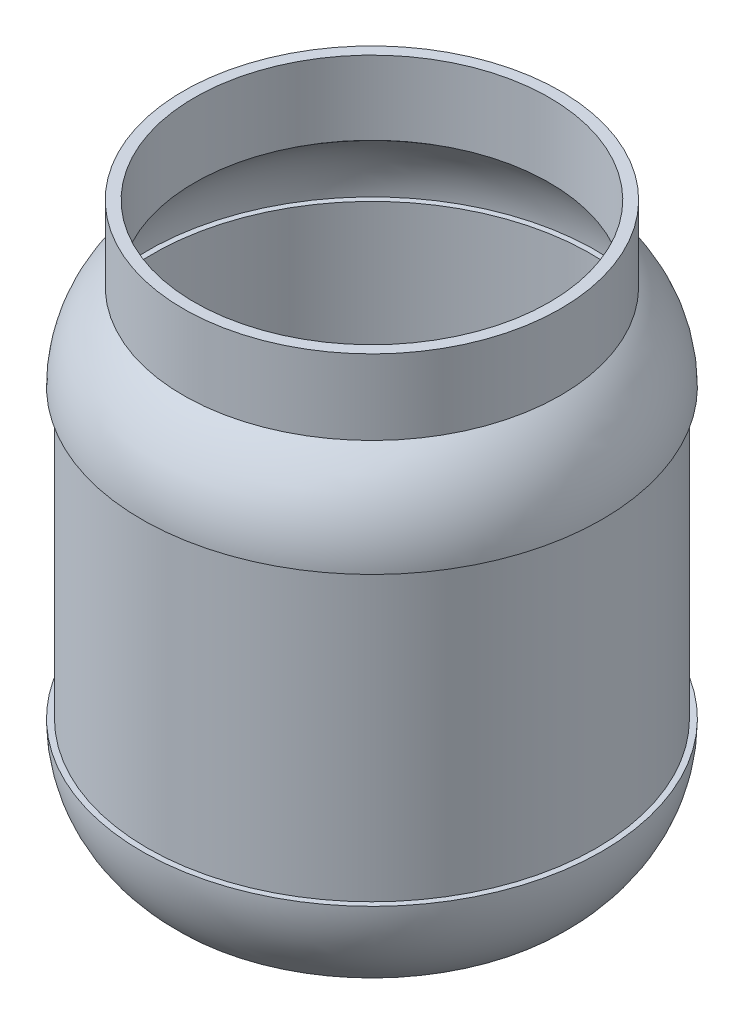
ISO-10303-21;
HEADER;
FILE_DESCRIPTION(('STEP AP214'),'2;1');
FILE_NAME('part.step','',(''),(''),'','','');
FILE_SCHEMA(('AUTOMOTIVE_DESIGN { 1 0 10303 214 1 1 1 1 }'));
ENDSEC;
DATA;
#1=APPLICATION_CONTEXT('core data for automotive mechanical design processes');
#2=APPLICATION_PROTOCOL_DEFINITION('international standard','automotive_design',2000,#1);
#3=PRODUCT_CONTEXT('',#1,'mechanical');
#4=PRODUCT('Part','Part','',(#3));
#5=PRODUCT_RELATED_PRODUCT_CATEGORY('part','',(#4));
#6=PRODUCT_DEFINITION_FORMATION('','',#4);
#7=PRODUCT_DEFINITION_CONTEXT('part definition',#1,'design');
#8=PRODUCT_DEFINITION('design','',#6,#7);
#9=PRODUCT_DEFINITION_SHAPE('','',#8);
#10=(LENGTH_UNIT() NAMED_UNIT(*) SI_UNIT(.MILLI.,.METRE.));
#11=(NAMED_UNIT(*) PLANE_ANGLE_UNIT() SI_UNIT($,.RADIAN.));
#12=(NAMED_UNIT(*) SI_UNIT($,.STERADIAN.) SOLID_ANGLE_UNIT());
#13=UNCERTAINTY_MEASURE_WITH_UNIT(LENGTH_MEASURE(1.E-05),#10,'distance_accuracy_value','');
#14=(GEOMETRIC_REPRESENTATION_CONTEXT(3) GLOBAL_UNCERTAINTY_ASSIGNED_CONTEXT((#13)) GLOBAL_UNIT_ASSIGNED_CONTEXT((#10,
#11,#12)) REPRESENTATION_CONTEXT('',''));
#15=CARTESIAN_POINT('',(0.,0.,0.));
#16=DIRECTION('',(0.,0.,1.));
#17=DIRECTION('',(1.,0.,0.));
#18=AXIS2_PLACEMENT_3D('',#15,#16,#17);
#19=CARTESIAN_POINT('',(0.,100.33,0.));
#20=DIRECTION('',(0.,-1.,0.));
#21=DIRECTION('',(1.,0.,0.));
#22=AXIS2_PLACEMENT_3D('',#19,#20,#21);
#23=TOROIDAL_SURFACE('',#22,33.6428148648649,29.8571851351351);
#24=CARTESIAN_POINT('',(0.,125.199035014533,0.));
#25=DIRECTION('',(0.,-1.,0.));
#26=DIRECTION('',(1.,0.,0.));
#27=AXIS2_PLACEMENT_3D('',#24,#25,#26);
#28=CIRCLE('',#27,50.165);
#29=CARTESIAN_POINT('',(50.165,125.199035014533,0.));
#30=VERTEX_POINT('',#29);
#31=EDGE_CURVE('E150',#30,#30,#28,.T.);
#32=ORIENTED_EDGE('',*,*,#31,.F.);
#33=EDGE_LOOP('',(#32));
#34=FACE_BOUND('',#33,.T.);
#35=CARTESIAN_POINT('',(0.,101.9175,0.));
#36=DIRECTION('',(0.,-1.,0.));
#37=DIRECTION('',(1.,0.,0.));
#38=AXIS2_PLACEMENT_3D('',#35,#36,#37);
#39=CIRCLE('',#38,63.4577666163558);
#40=CARTESIAN_POINT('',(63.4577666163558,101.9175,0.));
#41=VERTEX_POINT('',#40);
#42=EDGE_CURVE('E10',#41,#41,#39,.T.);
#43=ORIENTED_EDGE('',*,*,#42,.T.);
#44=EDGE_LOOP('',(#43));
#45=FACE_BOUND('',#44,.T.);
#46=ADVANCED_FACE('F43',(#34,#45),#23,.F.);
#47=CARTESIAN_POINT('',(0.,101.9175,0.));
#48=DIRECTION('',(0.,-1.,0.));
#49=DIRECTION('',(1.,0.,0.));
#50=AXIS2_PLACEMENT_3D('',#47,#48,#49);
#51=PLANE('',#50);
#52=ORIENTED_EDGE('',*,*,#42,.F.);
#53=EDGE_LOOP('',(#52));
#54=FACE_BOUND('',#53,.T.);
#55=CARTESIAN_POINT('',(0.,101.9175,0.));
#56=DIRECTION('',(0.,-1.,0.));
#57=DIRECTION('',(1.,0.,0.));
#58=AXIS2_PLACEMENT_3D('',#55,#56,#57);
#59=CIRCLE('',#58,61.9125);
#60=CARTESIAN_POINT('',(61.9125,101.9175,0.));
#61=VERTEX_POINT('',#60);
#62=EDGE_CURVE('E50',#61,#61,#59,.T.);
#63=ORIENTED_EDGE('',*,*,#62,.T.);
#64=EDGE_LOOP('',(#63));
#65=FACE_BOUND('',#64,.T.);
#66=ADVANCED_FACE('F159',(#54,#65),#51,.F.);
#67=CARTESIAN_POINT('',(0.,0.,0.));
#68=DIRECTION('',(0.,-1.,0.));
#69=DIRECTION('',(1.,0.,0.));
#70=AXIS2_PLACEMENT_3D('',#67,#68,#69);
#71=CYLINDRICAL_SURFACE('',#70,61.9125);
#72=ORIENTED_EDGE('',*,*,#62,.F.);
#73=EDGE_LOOP('',(#72));
#74=FACE_BOUND('',#73,.T.);
#75=CARTESIAN_POINT('',(0.,17.4625,0.));
#76=DIRECTION('',(0.,-1.,0.));
#77=DIRECTION('',(1.,0.,0.));
#78=AXIS2_PLACEMENT_3D('',#75,#76,#77);
#79=CIRCLE('',#78,61.9125);
#80=CARTESIAN_POINT('',(61.9125,17.4625,0.));
#81=VERTEX_POINT('',#80);
#82=EDGE_CURVE('E55',#81,#81,#79,.T.);
#83=ORIENTED_EDGE('',*,*,#82,.T.);
#84=EDGE_LOOP('',(#83));
#85=FACE_BOUND('',#84,.T.);
#86=ADVANCED_FACE('F163',(#74,#85),#71,.F.);
#87=CARTESIAN_POINT('',(0.,17.4625,0.));
#88=DIRECTION('',(0.,-1.,0.));
#89=DIRECTION('',(1.,0.,0.));
#90=AXIS2_PLACEMENT_3D('',#87,#88,#89);
#91=PLANE('',#90);
#92=CARTESIAN_POINT('',(0.,17.4625,0.));
#93=DIRECTION('',(0.,-1.,0.));
#94=DIRECTION('',(1.,0.,0.));
#95=AXIS2_PLACEMENT_3D('',#92,#93,#94);
#96=CIRCLE('',#95,63.4617905923927);
#97=CARTESIAN_POINT('',(63.4617905923927,17.4625,0.));
#98=VERTEX_POINT('',#97);
#99=EDGE_CURVE('E60',#98,#98,#96,.T.);
#100=ORIENTED_EDGE('',*,*,#99,.T.);
#101=EDGE_LOOP('',(#100));
#102=FACE_BOUND('',#101,.T.);
#103=ORIENTED_EDGE('',*,*,#82,.F.);
#104=EDGE_LOOP('',(#103));
#105=FACE_BOUND('',#104,.T.);
#106=ADVANCED_FACE('F168',(#102,#105),#91,.T.);
#107=CARTESIAN_POINT('',(0.,19.05,0.));
#108=DIRECTION('',(0.,-1.,0.));
#109=DIRECTION('',(1.,0.,0.));
#110=AXIS2_PLACEMENT_3D('',#107,#108,#109);
#111=DEGENERATE_TOROIDAL_SURFACE('',#110,30.5026785714286,32.9973214285714,.T.);
#112=CARTESIAN_POINT('',(0.,-4.7625,0.));
#113=DIRECTION('',(0.,-1.,0.));
#114=DIRECTION('',(1.,0.,0.));
#115=AXIS2_PLACEMENT_3D('',#112,#113,#114);
#116=CIRCLE('',#115,53.3453593512858);
#117=CARTESIAN_POINT('',(53.3453593512858,-4.7625,0.));
#118=VERTEX_POINT('',#117);
#119=EDGE_CURVE('E66',#118,#118,#116,.T.);
#120=ORIENTED_EDGE('',*,*,#119,.T.);
#121=EDGE_LOOP('',(#120));
#122=FACE_BOUND('',#121,.T.);
#123=ORIENTED_EDGE('',*,*,#99,.F.);
#124=EDGE_LOOP('',(#123));
#125=FACE_BOUND('',#124,.T.);
#126=ADVANCED_FACE('F174',(#122,#125),#111,.F.);
#127=CARTESIAN_POINT('',(0.,-4.7625,0.));
#128=DIRECTION('',(0.,-1.,0.));
#129=DIRECTION('',(1.,0.,0.));
#130=AXIS2_PLACEMENT_3D('',#127,#128,#129);
#131=PLANE('',#130);
#132=ORIENTED_EDGE('',*,*,#119,.F.);
#133=EDGE_LOOP('',(#132));
#134=FACE_BOUND('',#133,.T.);
#135=CARTESIAN_POINT('',(0.,-4.7625,0.));
#136=DIRECTION('',(0.,-1.,0.));
#137=DIRECTION('',(1.,0.,0.));
#138=AXIS2_PLACEMENT_3D('',#135,#136,#137);
#139=CIRCLE('',#138,51.4766208782978);
#140=CARTESIAN_POINT('',(51.4766208782978,-4.7625,0.));
#141=VERTEX_POINT('',#140);
#142=EDGE_CURVE('E70',#141,#141,#139,.T.);
#143=ORIENTED_EDGE('',*,*,#142,.T.);
#144=EDGE_LOOP('',(#143));
#145=FACE_BOUND('',#144,.T.);
#146=ADVANCED_FACE('F178',(#134,#145),#131,.F.);
#147=CARTESIAN_POINT('',(0.,-2.64583333333333,0.));
#148=DIRECTION('',(0.,-1.,0.));
#149=DIRECTION('',(1.,0.,0.));
#150=AXIS2_PLACEMENT_3D('',#147,#148,#149);
#151=CONICAL_SURFACE('',#150,49.4446208782977,0.764992832710913);
#152=ORIENTED_EDGE('',*,*,#142,.F.);
#153=EDGE_LOOP('',(#152));
#154=FACE_BOUND('',#153,.T.);
#155=CARTESIAN_POINT('',(0.,-2.64583333333333,0.));
#156=DIRECTION('',(0.,-1.,0.));
#157=DIRECTION('',(1.,0.,0.));
#158=AXIS2_PLACEMENT_3D('',#155,#156,#157);
#159=CIRCLE('',#158,49.4446208782977);
#160=CARTESIAN_POINT('',(49.4446208782977,-2.64583333333333,0.));
#161=VERTEX_POINT('',#160);
#162=EDGE_CURVE('E74',#161,#161,#159,.T.);
#163=ORIENTED_EDGE('',*,*,#162,.T.);
#164=EDGE_LOOP('',(#163));
#165=FACE_BOUND('',#164,.T.);
#166=ADVANCED_FACE('F182',(#154,#165),#151,.T.);
#167=CARTESIAN_POINT('',(0.,-2.64583333333333,0.));
#168=DIRECTION('',(0.,-1.,0.));
#169=DIRECTION('',(1.,0.,0.));
#170=AXIS2_PLACEMENT_3D('',#167,#168,#169);
#171=PLANE('',#170);
#172=ORIENTED_EDGE('',*,*,#162,.F.);
#173=EDGE_LOOP('',(#172));
#174=FACE_BOUND('',#173,.T.);
#175=CARTESIAN_POINT('',(0.,-2.64583333333333,0.));
#176=DIRECTION('',(0.,-1.,0.));
#177=DIRECTION('',(1.,0.,0.));
#178=AXIS2_PLACEMENT_3D('',#175,#176,#177);
#179=CIRCLE('',#178,27.8546208782978);
#180=CARTESIAN_POINT('',(27.8546208782978,-2.64583333333333,0.));
#181=VERTEX_POINT('',#180);
#182=EDGE_CURVE('E78',#181,#181,#179,.T.);
#183=ORIENTED_EDGE('',*,*,#182,.T.);
#184=EDGE_LOOP('',(#183));
#185=FACE_BOUND('',#184,.T.);
#186=ADVANCED_FACE('F186',(#174,#185),#171,.F.);
#187=CARTESIAN_POINT('',(0.,-0.529166666666666,0.));
#188=DIRECTION('',(0.,-1.,0.));
#189=DIRECTION('',(1.,0.,0.));
#190=AXIS2_PLACEMENT_3D('',#187,#188,#189);
#191=CONICAL_SURFACE('',#190,25.8226208782978,0.764992832710911);
#192=ORIENTED_EDGE('',*,*,#182,.F.);
#193=EDGE_LOOP('',(#192));
#194=FACE_BOUND('',#193,.T.);
#195=CARTESIAN_POINT('',(0.,-0.529166666666666,0.));
#196=DIRECTION('',(0.,-1.,0.));
#197=DIRECTION('',(1.,0.,0.));
#198=AXIS2_PLACEMENT_3D('',#195,#196,#197);
#199=CIRCLE('',#198,25.8226208782978);
#200=CARTESIAN_POINT('',(25.8226208782978,-0.529166666666666,0.));
#201=VERTEX_POINT('',#200);
#202=EDGE_CURVE('E82',#201,#201,#199,.T.);
#203=ORIENTED_EDGE('',*,*,#202,.T.);
#204=EDGE_LOOP('',(#203));
#205=FACE_BOUND('',#204,.T.);
#206=ADVANCED_FACE('F190',(#194,#205),#191,.T.);
#207=CARTESIAN_POINT('',(0.,-0.529166666666666,0.));
#208=DIRECTION('',(0.,-1.,0.));
#209=DIRECTION('',(1.,0.,0.));
#210=AXIS2_PLACEMENT_3D('',#207,#208,#209);
#211=PLANE('',#210);
#212=ORIENTED_EDGE('',*,*,#202,.F.);
#213=EDGE_LOOP('',(#212));
#214=FACE_BOUND('',#213,.T.);
#215=CARTESIAN_POINT('',(0.,-0.529166666666666,0.));
#216=DIRECTION('',(0.,-1.,0.));
#217=DIRECTION('',(1.,0.,0.));
#218=AXIS2_PLACEMENT_3D('',#215,#216,#217);
#219=CIRCLE('',#218,15.4086208782978);
#220=CARTESIAN_POINT('',(15.4086208782978,-0.529166666666666,0.));
#221=VERTEX_POINT('',#220);
#222=EDGE_CURVE('E86',#221,#221,#219,.T.);
#223=ORIENTED_EDGE('',*,*,#222,.T.);
#224=EDGE_LOOP('',(#223));
#225=FACE_BOUND('',#224,.T.);
#226=ADVANCED_FACE('F194',(#214,#225),#211,.F.);
#227=CARTESIAN_POINT('',(0.,1.5875,0.));
#228=DIRECTION('',(0.,-1.,0.));
#229=DIRECTION('',(1.,0.,0.));
#230=AXIS2_PLACEMENT_3D('',#227,#228,#229);
#231=CONICAL_SURFACE('',#230,13.3766208782978,0.764992832710911);
#232=ORIENTED_EDGE('',*,*,#222,.F.);
#233=EDGE_LOOP('',(#232));
#234=FACE_BOUND('',#233,.T.);
#235=CARTESIAN_POINT('',(0.,1.5875,0.));
#236=DIRECTION('',(0.,-1.,0.));
#237=DIRECTION('',(1.,0.,0.));
#238=AXIS2_PLACEMENT_3D('',#235,#236,#237);
#239=CIRCLE('',#238,13.3766208782978);
#240=CARTESIAN_POINT('',(13.3766208782978,1.5875,0.));
#241=VERTEX_POINT('',#240);
#242=EDGE_CURVE('E90',#241,#241,#239,.T.);
#243=ORIENTED_EDGE('',*,*,#242,.T.);
#244=EDGE_LOOP('',(#243));
#245=FACE_BOUND('',#244,.T.);
#246=ADVANCED_FACE('F198',(#234,#245),#231,.T.);
#247=CARTESIAN_POINT('',(0.,1.5875,0.));
#248=DIRECTION('',(0.,-1.,0.));
#249=DIRECTION('',(1.,0.,0.));
#250=AXIS2_PLACEMENT_3D('',#247,#248,#249);
#251=PLANE('',#250);
#252=ORIENTED_EDGE('',*,*,#242,.F.);
#253=EDGE_LOOP('',(#252));
#254=FACE_BOUND('',#253,.T.);
#255=ADVANCED_FACE('F202',(#254),#251,.F.);
#256=CARTESIAN_POINT('',(0.,0.,0.));
#257=DIRECTION('',(0.,-1.,0.));
#258=DIRECTION('',(1.,0.,0.));
#259=AXIS2_PLACEMENT_3D('',#256,#257,#258);
#260=PLANE('',#259);
#261=CARTESIAN_POINT('',(0.,0.,0.));
#262=DIRECTION('',(0.,-1.,0.));
#263=DIRECTION('',(1.,0.,0.));
#264=AXIS2_PLACEMENT_3D('',#261,#262,#263);
#265=CIRCLE('',#264,12.7);
#266=CARTESIAN_POINT('',(12.7,0.,0.));
#267=VERTEX_POINT('',#266);
#268=EDGE_CURVE('E94',#267,#267,#265,.T.);
#269=ORIENTED_EDGE('',*,*,#268,.T.);
#270=EDGE_LOOP('',(#269));
#271=FACE_BOUND('',#270,.T.);
#272=ADVANCED_FACE('F206',(#271),#260,.T.);
#273=CARTESIAN_POINT('',(0.,0.,0.));
#274=DIRECTION('',(0.,-1.,0.));
#275=DIRECTION('',(1.,0.,0.));
#276=AXIS2_PLACEMENT_3D('',#273,#274,#275);
#277=CONICAL_SURFACE('',#276,12.7,0.76499283271091);
#278=CARTESIAN_POINT('',(0.,-2.11666666666667,0.));
#279=DIRECTION('',(0.,-1.,0.));
#280=DIRECTION('',(1.,0.,0.));
#281=AXIS2_PLACEMENT_3D('',#278,#279,#280);
#282=CIRCLE('',#281,14.732);
#283=CARTESIAN_POINT('',(14.732,-2.11666666666667,0.));
#284=VERTEX_POINT('',#283);
#285=EDGE_CURVE('E98',#284,#284,#282,.T.);
#286=ORIENTED_EDGE('',*,*,#285,.T.);
#287=EDGE_LOOP('',(#286));
#288=FACE_BOUND('',#287,.T.);
#289=ORIENTED_EDGE('',*,*,#268,.F.);
#290=EDGE_LOOP('',(#289));
#291=FACE_BOUND('',#290,.T.);
#292=ADVANCED_FACE('F210',(#288,#291),#277,.F.);
#293=CARTESIAN_POINT('',(0.,-2.11666666666667,0.));
#294=DIRECTION('',(0.,-1.,0.));
#295=DIRECTION('',(1.,0.,0.));
#296=AXIS2_PLACEMENT_3D('',#293,#294,#295);
#297=PLANE('',#296);
#298=CARTESIAN_POINT('',(0.,-2.11666666666667,0.));
#299=DIRECTION('',(0.,-1.,0.));
#300=DIRECTION('',(1.,0.,0.));
#301=AXIS2_PLACEMENT_3D('',#298,#299,#300);
#302=CIRCLE('',#301,25.146);
#303=CARTESIAN_POINT('',(25.146,-2.11666666666667,0.));
#304=VERTEX_POINT('',#303);
#305=EDGE_CURVE('E102',#304,#304,#302,.T.);
#306=ORIENTED_EDGE('',*,*,#305,.T.);
#307=EDGE_LOOP('',(#306));
#308=FACE_BOUND('',#307,.T.);
#309=ORIENTED_EDGE('',*,*,#285,.F.);
#310=EDGE_LOOP('',(#309));
#311=FACE_BOUND('',#310,.T.);
#312=ADVANCED_FACE('F214',(#308,#311),#297,.T.);
#313=CARTESIAN_POINT('',(0.,-2.11666666666667,0.));
#314=DIRECTION('',(0.,-1.,0.));
#315=DIRECTION('',(1.,0.,0.));
#316=AXIS2_PLACEMENT_3D('',#313,#314,#315);
#317=CONICAL_SURFACE('',#316,25.146,0.76499283271091);
#318=CARTESIAN_POINT('',(0.,-4.23333333333333,0.));
#319=DIRECTION('',(0.,-1.,0.));
#320=DIRECTION('',(1.,0.,0.));
#321=AXIS2_PLACEMENT_3D('',#318,#319,#320);
#322=CIRCLE('',#321,27.178);
#323=CARTESIAN_POINT('',(27.178,-4.23333333333333,0.));
#324=VERTEX_POINT('',#323);
#325=EDGE_CURVE('E106',#324,#324,#322,.T.);
#326=ORIENTED_EDGE('',*,*,#325,.T.);
#327=EDGE_LOOP('',(#326));
#328=FACE_BOUND('',#327,.T.);
#329=ORIENTED_EDGE('',*,*,#305,.F.);
#330=EDGE_LOOP('',(#329));
#331=FACE_BOUND('',#330,.T.);
#332=ADVANCED_FACE('F218',(#328,#331),#317,.F.);
#333=CARTESIAN_POINT('',(0.,-4.23333333333333,0.));
#334=DIRECTION('',(0.,-1.,0.));
#335=DIRECTION('',(1.,0.,0.));
#336=AXIS2_PLACEMENT_3D('',#333,#334,#335);
#337=PLANE('',#336);
#338=CARTESIAN_POINT('',(0.,-4.23333333333333,0.));
#339=DIRECTION('',(0.,-1.,0.));
#340=DIRECTION('',(1.,0.,0.));
#341=AXIS2_PLACEMENT_3D('',#338,#339,#340);
#342=CIRCLE('',#341,48.768);
#343=CARTESIAN_POINT('',(48.768,-4.23333333333333,0.));
#344=VERTEX_POINT('',#343);
#345=EDGE_CURVE('E110',#344,#344,#342,.T.);
#346=ORIENTED_EDGE('',*,*,#345,.T.);
#347=EDGE_LOOP('',(#346));
#348=FACE_BOUND('',#347,.T.);
#349=ORIENTED_EDGE('',*,*,#325,.F.);
#350=EDGE_LOOP('',(#349));
#351=FACE_BOUND('',#350,.T.);
#352=ADVANCED_FACE('F222',(#348,#351),#337,.T.);
#353=CARTESIAN_POINT('',(0.,-4.23333333333333,0.));
#354=DIRECTION('',(0.,-1.,0.));
#355=DIRECTION('',(1.,0.,0.));
#356=AXIS2_PLACEMENT_3D('',#353,#354,#355);
#357=CONICAL_SURFACE('',#356,48.768,0.764992832710914);
#358=CARTESIAN_POINT('',(0.,-6.34999999999999,0.));
#359=DIRECTION('',(0.,-1.,0.));
#360=DIRECTION('',(1.,0.,0.));
#361=AXIS2_PLACEMENT_3D('',#358,#359,#360);
#362=CIRCLE('',#361,50.8);
#363=CARTESIAN_POINT('',(50.8,-6.34999999999999,0.));
#364=VERTEX_POINT('',#363);
#365=EDGE_CURVE('E114',#364,#364,#362,.T.);
#366=ORIENTED_EDGE('',*,*,#365,.T.);
#367=EDGE_LOOP('',(#366));
#368=FACE_BOUND('',#367,.T.);
#369=ORIENTED_EDGE('',*,*,#345,.F.);
#370=EDGE_LOOP('',(#369));
#371=FACE_BOUND('',#370,.T.);
#372=ADVANCED_FACE('F226',(#368,#371),#357,.F.);
#373=CARTESIAN_POINT('',(0.,-6.34999999999999,0.));
#374=DIRECTION('',(0.,-1.,0.));
#375=DIRECTION('',(1.,0.,0.));
#376=AXIS2_PLACEMENT_3D('',#373,#374,#375);
#377=PLANE('',#376);
#378=CARTESIAN_POINT('',(0.,-6.34999999999999,0.));
#379=DIRECTION('',(0.,-1.,0.));
#380=DIRECTION('',(1.,0.,0.));
#381=AXIS2_PLACEMENT_3D('',#378,#379,#380);
#382=CIRCLE('',#381,53.975);
#383=CARTESIAN_POINT('',(53.975,-6.34999999999999,0.));
#384=VERTEX_POINT('',#383);
#385=EDGE_CURVE('E118',#384,#384,#382,.T.);
#386=ORIENTED_EDGE('',*,*,#385,.T.);
#387=EDGE_LOOP('',(#386));
#388=FACE_BOUND('',#387,.T.);
#389=ORIENTED_EDGE('',*,*,#365,.F.);
#390=EDGE_LOOP('',(#389));
#391=FACE_BOUND('',#390,.T.);
#392=ADVANCED_FACE('F230',(#388,#391),#377,.T.);
#393=CARTESIAN_POINT('',(0.,19.05,0.));
#394=DIRECTION('',(0.,-1.,0.));
#395=DIRECTION('',(1.,0.,0.));
#396=AXIS2_PLACEMENT_3D('',#393,#394,#395);
#397=DEGENERATE_TOROIDAL_SURFACE('',#396,30.5026785714286,34.5848214285714,.T.);
#398=ORIENTED_EDGE('',*,*,#385,.F.);
#399=EDGE_LOOP('',(#398));
#400=FACE_BOUND('',#399,.T.);
#401=CARTESIAN_POINT('',(0.,19.05,0.));
#402=DIRECTION('',(0.,-1.,0.));
#403=DIRECTION('',(1.,0.,0.));
#404=AXIS2_PLACEMENT_3D('',#401,#402,#403);
#405=CIRCLE('',#404,65.0875);
#406=CARTESIAN_POINT('',(65.0875,19.05,0.));
#407=VERTEX_POINT('',#406);
#408=EDGE_CURVE('E122',#407,#407,#405,.T.);
#409=ORIENTED_EDGE('',*,*,#408,.T.);
#410=EDGE_LOOP('',(#409));
#411=FACE_BOUND('',#410,.T.);
#412=ADVANCED_FACE('F234',(#400,#411),#397,.T.);
#413=CARTESIAN_POINT('',(0.,19.05,0.));
#414=DIRECTION('',(0.,-1.,0.));
#415=DIRECTION('',(1.,0.,0.));
#416=AXIS2_PLACEMENT_3D('',#413,#414,#415);
#417=PLANE('',#416);
#418=ORIENTED_EDGE('',*,*,#408,.F.);
#419=EDGE_LOOP('',(#418));
#420=FACE_BOUND('',#419,.T.);
#421=CARTESIAN_POINT('',(0.,19.05,0.));
#422=DIRECTION('',(0.,-1.,0.));
#423=DIRECTION('',(1.,0.,0.));
#424=AXIS2_PLACEMENT_3D('',#421,#422,#423);
#425=CIRCLE('',#424,63.5);
#426=CARTESIAN_POINT('',(63.5,19.05,0.));
#427=VERTEX_POINT('',#426);
#428=EDGE_CURVE('E126',#427,#427,#425,.T.);
#429=ORIENTED_EDGE('',*,*,#428,.T.);
#430=EDGE_LOOP('',(#429));
#431=FACE_BOUND('',#430,.T.);
#432=ADVANCED_FACE('F238',(#420,#431),#417,.F.);
#433=CARTESIAN_POINT('',(0.,0.,0.));
#434=DIRECTION('',(0.,-1.,0.));
#435=DIRECTION('',(1.,0.,0.));
#436=AXIS2_PLACEMENT_3D('',#433,#434,#435);
#437=CYLINDRICAL_SURFACE('',#436,63.5);
#438=CARTESIAN_POINT('',(0.,100.33,0.));
#439=DIRECTION('',(0.,-1.,0.));
#440=DIRECTION('',(1.,0.,0.));
#441=AXIS2_PLACEMENT_3D('',#438,#439,#440);
#442=CIRCLE('',#441,63.5);
#443=CARTESIAN_POINT('',(63.5,100.33,0.));
#444=VERTEX_POINT('',#443);
#445=EDGE_CURVE('E130',#444,#444,#442,.T.);
#446=ORIENTED_EDGE('',*,*,#445,.T.);
#447=EDGE_LOOP('',(#446));
#448=FACE_BOUND('',#447,.T.);
#449=ORIENTED_EDGE('',*,*,#428,.F.);
#450=EDGE_LOOP('',(#449));
#451=FACE_BOUND('',#450,.T.);
#452=ADVANCED_FACE('F242',(#448,#451),#437,.T.);
#453=CARTESIAN_POINT('',(0.,100.33,0.));
#454=DIRECTION('',(0.,-1.,0.));
#455=DIRECTION('',(1.,0.,0.));
#456=AXIS2_PLACEMENT_3D('',#453,#454,#455);
#457=PLANE('',#456);
#458=CARTESIAN_POINT('',(0.,100.33,0.));
#459=DIRECTION('',(0.,-1.,0.));
#460=DIRECTION('',(1.,0.,0.));
#461=AXIS2_PLACEMENT_3D('',#458,#459,#460);
#462=CIRCLE('',#461,65.0875);
#463=CARTESIAN_POINT('',(65.0875,100.33,0.));
#464=VERTEX_POINT('',#463);
#465=EDGE_CURVE('E134',#464,#464,#462,.T.);
#466=ORIENTED_EDGE('',*,*,#465,.T.);
#467=EDGE_LOOP('',(#466));
#468=FACE_BOUND('',#467,.T.);
#469=ORIENTED_EDGE('',*,*,#445,.F.);
#470=EDGE_LOOP('',(#469));
#471=FACE_BOUND('',#470,.T.);
#472=ADVANCED_FACE('F246',(#468,#471),#457,.T.);
#473=CARTESIAN_POINT('',(0.,100.33,0.));
#474=DIRECTION('',(0.,-1.,0.));
#475=DIRECTION('',(1.,0.,0.));
#476=AXIS2_PLACEMENT_3D('',#473,#474,#475);
#477=TOROIDAL_SURFACE('',#476,33.6428148648649,31.4446851351351);
#478=CARTESIAN_POINT('',(0.,124.841,0.));
#479=DIRECTION('',(0.,-1.,0.));
#480=DIRECTION('',(1.,0.,0.));
#481=AXIS2_PLACEMENT_3D('',#478,#479,#480);
#482=CIRCLE('',#481,53.34);
#483=CARTESIAN_POINT('',(53.34,124.841,0.));
#484=VERTEX_POINT('',#483);
#485=EDGE_CURVE('E138',#484,#484,#482,.T.);
#486=ORIENTED_EDGE('',*,*,#485,.T.);
#487=EDGE_LOOP('',(#486));
#488=FACE_BOUND('',#487,.T.);
#489=ORIENTED_EDGE('',*,*,#465,.F.);
#490=EDGE_LOOP('',(#489));
#491=FACE_BOUND('',#490,.T.);
#492=ADVANCED_FACE('F250',(#488,#491),#477,.T.);
#493=CARTESIAN_POINT('',(0.,0.,0.));
#494=DIRECTION('',(0.,-1.,0.));
#495=DIRECTION('',(1.,0.,0.));
#496=AXIS2_PLACEMENT_3D('',#493,#494,#495);
#497=CYLINDRICAL_SURFACE('',#496,53.34);
#498=CARTESIAN_POINT('',(0.,146.05,0.));
#499=DIRECTION('',(0.,-1.,0.));
#500=DIRECTION('',(1.,0.,0.));
#501=AXIS2_PLACEMENT_3D('',#498,#499,#500);
#502=CIRCLE('',#501,53.34);
#503=CARTESIAN_POINT('',(53.34,146.05,0.));
#504=VERTEX_POINT('',#503);
#505=EDGE_CURVE('E142',#504,#504,#502,.T.);
#506=ORIENTED_EDGE('',*,*,#505,.T.);
#507=EDGE_LOOP('',(#506));
#508=FACE_BOUND('',#507,.T.);
#509=ORIENTED_EDGE('',*,*,#485,.F.);
#510=EDGE_LOOP('',(#509));
#511=FACE_BOUND('',#510,.T.);
#512=ADVANCED_FACE('F254',(#508,#511),#497,.T.);
#513=CARTESIAN_POINT('',(0.,146.05,0.));
#514=DIRECTION('',(0.,1.,0.));
#515=DIRECTION('',(-1.,0.,0.));
#516=AXIS2_PLACEMENT_3D('',#513,#514,#515);
#517=PLANE('',#516);
#518=CARTESIAN_POINT('',(0.,146.05,0.));
#519=DIRECTION('',(0.,-1.,0.));
#520=DIRECTION('',(1.,0.,0.));
#521=AXIS2_PLACEMENT_3D('',#518,#519,#520);
#522=CIRCLE('',#521,50.165);
#523=CARTESIAN_POINT('',(50.165,146.05,0.));
#524=VERTEX_POINT('',#523);
#525=EDGE_CURVE('E146',#524,#524,#522,.T.);
#526=ORIENTED_EDGE('',*,*,#525,.T.);
#527=EDGE_LOOP('',(#526));
#528=FACE_BOUND('',#527,.T.);
#529=ORIENTED_EDGE('',*,*,#505,.F.);
#530=EDGE_LOOP('',(#529));
#531=FACE_BOUND('',#530,.T.);
#532=ADVANCED_FACE('F258',(#528,#531),#517,.T.);
#533=CARTESIAN_POINT('',(0.,0.,0.));
#534=DIRECTION('',(0.,-1.,0.));
#535=DIRECTION('',(1.,0.,0.));
#536=AXIS2_PLACEMENT_3D('',#533,#534,#535);
#537=CYLINDRICAL_SURFACE('',#536,50.165);
#538=ORIENTED_EDGE('',*,*,#31,.T.);
#539=EDGE_LOOP('',(#538));
#540=FACE_BOUND('',#539,.T.);
#541=ORIENTED_EDGE('',*,*,#525,.F.);
#542=EDGE_LOOP('',(#541));
#543=FACE_BOUND('',#542,.T.);
#544=ADVANCED_FACE('F155',(#540,#543),#537,.F.);
#545=CLOSED_SHELL('',(#46,#66,#86,#106,#126,#146,#166,#186,#206,#226,#246,#255,#272,#292,#312,
#332,#352,#372,#392,#412,#432,#452,#472,#492,#512,#532,#544));
#546=MANIFOLD_SOLID_BREP('B2',#545);
#547=ADVANCED_BREP_SHAPE_REPRESENTATION('',(#18,#546),#14);
#548=SHAPE_DEFINITION_REPRESENTATION(#9,#547);
ENDSEC;
END-ISO-10303-21;
